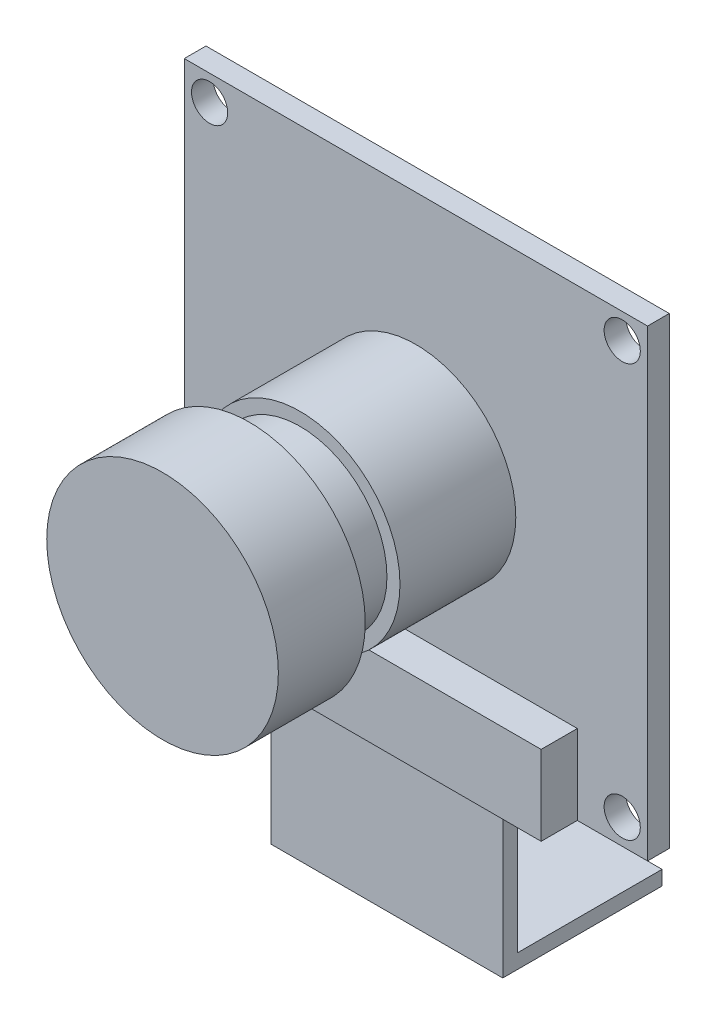
ISO-10303-21;
HEADER;
FILE_DESCRIPTION(('STEP AP214'),'2;1');
FILE_NAME('part.step','',(''),(''),'','','');
FILE_SCHEMA(('AUTOMOTIVE_DESIGN { 1 0 10303 214 1 1 1 1 }'));
ENDSEC;
DATA;
#1=APPLICATION_CONTEXT('core data for automotive mechanical design processes');
#2=APPLICATION_PROTOCOL_DEFINITION('international standard','automotive_design',2000,#1);
#3=PRODUCT_CONTEXT('',#1,'mechanical');
#4=PRODUCT('Part','Part','',(#3));
#5=PRODUCT_RELATED_PRODUCT_CATEGORY('part','',(#4));
#6=PRODUCT_DEFINITION_FORMATION('','',#4);
#7=PRODUCT_DEFINITION_CONTEXT('part definition',#1,'design');
#8=PRODUCT_DEFINITION('design','',#6,#7);
#9=PRODUCT_DEFINITION_SHAPE('','',#8);
#10=(LENGTH_UNIT() NAMED_UNIT(*) SI_UNIT(.MILLI.,.METRE.));
#11=(NAMED_UNIT(*) PLANE_ANGLE_UNIT() SI_UNIT($,.RADIAN.));
#12=(NAMED_UNIT(*) SI_UNIT($,.STERADIAN.) SOLID_ANGLE_UNIT());
#13=UNCERTAINTY_MEASURE_WITH_UNIT(LENGTH_MEASURE(1.E-05),#10,'distance_accuracy_value','');
#14=(GEOMETRIC_REPRESENTATION_CONTEXT(3) GLOBAL_UNCERTAINTY_ASSIGNED_CONTEXT((#13)) GLOBAL_UNIT_ASSIGNED_CONTEXT((#10,
#11,#12)) REPRESENTATION_CONTEXT('',''));
#15=CARTESIAN_POINT('',(0.,0.,0.));
#16=DIRECTION('',(0.,0.,1.));
#17=DIRECTION('',(1.,0.,0.));
#18=AXIS2_PLACEMENT_3D('',#15,#16,#17);
#19=CARTESIAN_POINT('',(0.,0.,1.5));
#20=DIRECTION('',(0.,0.,1.));
#21=DIRECTION('',(1.,0.,0.));
#22=AXIS2_PLACEMENT_3D('',#19,#20,#21);
#23=PLANE('',#22);
#24=CARTESIAN_POINT('',(0.,0.,1.5));
#25=DIRECTION('',(0.,0.,1.));
#26=DIRECTION('',(1.,0.,0.));
#27=AXIS2_PLACEMENT_3D('',#24,#25,#26);
#28=CIRCLE('',#27,6.9);
#29=CARTESIAN_POINT('',(6.9,0.,1.5));
#30=VERTEX_POINT('',#29);
#31=EDGE_CURVE('E231',#30,#30,#28,.T.);
#32=ORIENTED_EDGE('',*,*,#31,.F.);
#33=EDGE_LOOP('',(#32));
#34=FACE_BOUND('',#33,.T.);
#35=CARTESIAN_POINT('',(-14.25,14.25,1.5));
#36=DIRECTION('',(0.,0.,1.));
#37=DIRECTION('',(1.,0.,0.));
#38=AXIS2_PLACEMENT_3D('',#35,#36,#37);
#39=CIRCLE('',#38,1.2500000000001);
#40=CARTESIAN_POINT('',(-12.9999999999999,14.25,1.5));
#41=VERTEX_POINT('',#40);
#42=EDGE_CURVE('E284',#41,#41,#39,.T.);
#43=ORIENTED_EDGE('',*,*,#42,.F.);
#44=EDGE_LOOP('',(#43));
#45=FACE_BOUND('',#44,.T.);
#46=CARTESIAN_POINT('',(-14.25,-14.25,1.5));
#47=DIRECTION('',(0.,0.,1.));
#48=DIRECTION('',(1.,0.,0.));
#49=AXIS2_PLACEMENT_3D('',#46,#47,#48);
#50=CIRCLE('',#49,1.25000000000007);
#51=CARTESIAN_POINT('',(-12.9999999999999,-14.25,1.5));
#52=VERTEX_POINT('',#51);
#53=EDGE_CURVE('E287',#52,#52,#50,.T.);
#54=ORIENTED_EDGE('',*,*,#53,.F.);
#55=EDGE_LOOP('',(#54));
#56=FACE_BOUND('',#55,.T.);
#57=CARTESIAN_POINT('',(14.25,-14.25,1.5));
#58=DIRECTION('',(0.,0.,1.));
#59=DIRECTION('',(1.,0.,0.));
#60=AXIS2_PLACEMENT_3D('',#57,#58,#59);
#61=CIRCLE('',#60,1.25000000000003);
#62=CARTESIAN_POINT('',(15.5,-14.25,1.5));
#63=VERTEX_POINT('',#62);
#64=EDGE_CURVE('E290',#63,#63,#61,.T.);
#65=ORIENTED_EDGE('',*,*,#64,.F.);
#66=EDGE_LOOP('',(#65));
#67=FACE_BOUND('',#66,.T.);
#68=CARTESIAN_POINT('',(14.25,14.25,1.5));
#69=DIRECTION('',(0.,0.,1.));
#70=DIRECTION('',(1.,0.,0.));
#71=AXIS2_PLACEMENT_3D('',#68,#69,#70);
#72=CIRCLE('',#71,1.25);
#73=CARTESIAN_POINT('',(15.5,14.25,1.5));
#74=VERTEX_POINT('',#73);
#75=EDGE_CURVE('E293',#74,#74,#72,.T.);
#76=ORIENTED_EDGE('',*,*,#75,.F.);
#77=EDGE_LOOP('',(#76));
#78=FACE_BOUND('',#77,.T.);
#79=DIRECTION('',(1.,0.,0.));
#80=VECTOR('',#79,1.);
#81=CARTESIAN_POINT('',(0.,-16.,1.5));
#82=LINE('',#81,#80);
#83=CARTESIAN_POINT('',(-16.,-16.,1.5));
#84=VERTEX_POINT('',#83);
#85=CARTESIAN_POINT('',(-11.15,-16.,1.5));
#86=VERTEX_POINT('',#85);
#87=EDGE_CURVE('E276',#84,#86,#82,.T.);
#88=ORIENTED_EDGE('',*,*,#87,.T.);
#89=DIRECTION('',(0.,1.,0.));
#90=VECTOR('',#89,1.);
#91=CARTESIAN_POINT('',(-11.15,0.,1.5));
#92=LINE('',#91,#90);
#93=CARTESIAN_POINT('',(-11.15,-10.5,1.5));
#94=VERTEX_POINT('',#93);
#95=EDGE_CURVE('E238',#86,#94,#92,.T.);
#96=ORIENTED_EDGE('',*,*,#95,.T.);
#97=DIRECTION('',(-1.,0.,0.));
#98=VECTOR('',#97,1.);
#99=CARTESIAN_POINT('',(0.,-10.5,1.5));
#100=LINE('',#99,#98);
#101=CARTESIAN_POINT('',(11.15,-10.5,1.5));
#102=VERTEX_POINT('',#101);
#103=EDGE_CURVE('E254',#102,#94,#100,.T.);
#104=ORIENTED_EDGE('',*,*,#103,.F.);
#105=DIRECTION('',(0.,1.,0.));
#106=VECTOR('',#105,1.);
#107=CARTESIAN_POINT('',(11.15,0.,1.5));
#108=LINE('',#107,#106);
#109=CARTESIAN_POINT('',(11.15,-16.,1.5));
#110=VERTEX_POINT('',#109);
#111=EDGE_CURVE('E245',#110,#102,#108,.T.);
#112=ORIENTED_EDGE('',*,*,#111,.F.);
#113=CARTESIAN_POINT('',(16.,-16.,1.5));
#114=VERTEX_POINT('',#113);
#115=EDGE_CURVE('E274',#110,#114,#82,.T.);
#116=ORIENTED_EDGE('',*,*,#115,.T.);
#117=DIRECTION('',(0.,-1.,0.));
#118=VECTOR('',#117,1.);
#119=CARTESIAN_POINT('',(16.,0.,1.5));
#120=LINE('',#119,#118);
#121=CARTESIAN_POINT('',(16.,16.,1.5));
#122=VERTEX_POINT('',#121);
#123=EDGE_CURVE('E278',#122,#114,#120,.T.);
#124=ORIENTED_EDGE('',*,*,#123,.F.);
#125=DIRECTION('',(1.,0.,0.));
#126=VECTOR('',#125,1.);
#127=CARTESIAN_POINT('',(0.,16.,1.5));
#128=LINE('',#127,#126);
#129=CARTESIAN_POINT('',(-16.,16.,1.5));
#130=VERTEX_POINT('',#129);
#131=EDGE_CURVE('E281',#130,#122,#128,.T.);
#132=ORIENTED_EDGE('',*,*,#131,.F.);
#133=DIRECTION('',(0.,-1.,0.));
#134=VECTOR('',#133,1.);
#135=CARTESIAN_POINT('',(-16.,0.,1.5));
#136=LINE('',#135,#134);
#137=EDGE_CURVE('E271',#130,#84,#136,.T.);
#138=ORIENTED_EDGE('',*,*,#137,.T.);
#139=EDGE_LOOP('',(#88,#96,#104,#112,#116,#124,#132,#138));
#140=FACE_BOUND('',#139,.T.);
#141=ADVANCED_FACE('F58',(#34,#45,#56,#67,#78,#140),#23,.T.);
#142=CARTESIAN_POINT('',(14.25,14.25,1.5));
#143=DIRECTION('',(0.,0.,-1.));
#144=DIRECTION('',(-1.,0.,0.));
#145=AXIS2_PLACEMENT_3D('',#142,#143,#144);
#146=CYLINDRICAL_SURFACE('',#145,1.25);
#147=ORIENTED_EDGE('',*,*,#75,.T.);
#148=EDGE_LOOP('',(#147));
#149=FACE_BOUND('',#148,.T.);
#150=CARTESIAN_POINT('',(14.25,14.25,0.));
#151=DIRECTION('',(0.,0.,1.));
#152=DIRECTION('',(1.,0.,0.));
#153=AXIS2_PLACEMENT_3D('',#150,#151,#152);
#154=CIRCLE('',#153,1.25);
#155=CARTESIAN_POINT('',(15.5,14.25,0.));
#156=VERTEX_POINT('',#155);
#157=EDGE_CURVE('E275',#156,#156,#154,.T.);
#158=ORIENTED_EDGE('',*,*,#157,.F.);
#159=EDGE_LOOP('',(#158));
#160=FACE_BOUND('',#159,.T.);
#161=ADVANCED_FACE('F370',(#149,#160),#146,.F.);
#162=CARTESIAN_POINT('',(14.25,-14.25,1.5));
#163=DIRECTION('',(0.,0.,-1.));
#164=DIRECTION('',(-1.,0.,0.));
#165=AXIS2_PLACEMENT_3D('',#162,#163,#164);
#166=CYLINDRICAL_SURFACE('',#165,1.25000000000003);
#167=ORIENTED_EDGE('',*,*,#64,.T.);
#168=EDGE_LOOP('',(#167));
#169=FACE_BOUND('',#168,.T.);
#170=CARTESIAN_POINT('',(14.25,-14.25,0.));
#171=DIRECTION('',(0.,0.,1.));
#172=DIRECTION('',(1.,0.,0.));
#173=AXIS2_PLACEMENT_3D('',#170,#171,#172);
#174=CIRCLE('',#173,1.25000000000003);
#175=CARTESIAN_POINT('',(15.5,-14.25,0.));
#176=VERTEX_POINT('',#175);
#177=EDGE_CURVE('E314',#176,#176,#174,.T.);
#178=ORIENTED_EDGE('',*,*,#177,.F.);
#179=EDGE_LOOP('',(#178));
#180=FACE_BOUND('',#179,.T.);
#181=ADVANCED_FACE('F376',(#169,#180),#166,.F.);
#182=CARTESIAN_POINT('',(-14.25,-14.25,1.5));
#183=DIRECTION('',(0.,0.,-1.));
#184=DIRECTION('',(-1.,0.,0.));
#185=AXIS2_PLACEMENT_3D('',#182,#183,#184);
#186=CYLINDRICAL_SURFACE('',#185,1.25000000000007);
#187=ORIENTED_EDGE('',*,*,#53,.T.);
#188=EDGE_LOOP('',(#187));
#189=FACE_BOUND('',#188,.T.);
#190=CARTESIAN_POINT('',(-14.25,-14.25,0.));
#191=DIRECTION('',(0.,0.,1.));
#192=DIRECTION('',(1.,0.,0.));
#193=AXIS2_PLACEMENT_3D('',#190,#191,#192);
#194=CIRCLE('',#193,1.25000000000007);
#195=CARTESIAN_POINT('',(-12.9999999999999,-14.25,0.));
#196=VERTEX_POINT('',#195);
#197=EDGE_CURVE('E311',#196,#196,#194,.T.);
#198=ORIENTED_EDGE('',*,*,#197,.F.);
#199=EDGE_LOOP('',(#198));
#200=FACE_BOUND('',#199,.T.);
#201=ADVANCED_FACE('F387',(#189,#200),#186,.F.);
#202=CARTESIAN_POINT('',(-14.25,14.25,1.5));
#203=DIRECTION('',(0.,0.,-1.));
#204=DIRECTION('',(-1.,0.,0.));
#205=AXIS2_PLACEMENT_3D('',#202,#203,#204);
#206=CYLINDRICAL_SURFACE('',#205,1.2500000000001);
#207=ORIENTED_EDGE('',*,*,#42,.T.);
#208=EDGE_LOOP('',(#207));
#209=FACE_BOUND('',#208,.T.);
#210=CARTESIAN_POINT('',(-14.25,14.25,0.));
#211=DIRECTION('',(0.,0.,1.));
#212=DIRECTION('',(1.,0.,0.));
#213=AXIS2_PLACEMENT_3D('',#210,#211,#212);
#214=CIRCLE('',#213,1.2500000000001);
#215=CARTESIAN_POINT('',(-12.9999999999999,14.25,0.));
#216=VERTEX_POINT('',#215);
#217=EDGE_CURVE('E308',#216,#216,#214,.T.);
#218=ORIENTED_EDGE('',*,*,#217,.F.);
#219=EDGE_LOOP('',(#218));
#220=FACE_BOUND('',#219,.T.);
#221=ADVANCED_FACE('F391',(#209,#220),#206,.F.);
#222=CARTESIAN_POINT('',(0.,-16.,1.5));
#223=DIRECTION('',(0.,1.,0.));
#224=DIRECTION('',(0.,0.,1.));
#225=AXIS2_PLACEMENT_3D('',#222,#223,#224);
#226=PLANE('',#225);
#227=DIRECTION('',(1.,0.,0.));
#228=VECTOR('',#227,1.);
#229=CARTESIAN_POINT('',(0.,-16.,3.5));
#230=LINE('',#229,#228);
#231=CARTESIAN_POINT('',(-8.,-16.,3.5));
#232=VERTEX_POINT('',#231);
#233=CARTESIAN_POINT('',(8.,-16.,3.5));
#234=VERTEX_POINT('',#233);
#235=EDGE_CURVE('E73',#232,#234,#230,.T.);
#236=ORIENTED_EDGE('',*,*,#235,.T.);
#237=DIRECTION('',(0.,0.,-1.));
#238=VECTOR('',#237,1.);
#239=CARTESIAN_POINT('',(8.,-16.,0.));
#240=LINE('',#239,#238);
#241=CARTESIAN_POINT('',(8.,-16.,2.5));
#242=VERTEX_POINT('',#241);
#243=EDGE_CURVE('E169',#234,#242,#240,.T.);
#244=ORIENTED_EDGE('',*,*,#243,.T.);
#245=DIRECTION('',(1.,0.,0.));
#246=VECTOR('',#245,1.);
#247=CARTESIAN_POINT('',(0.,-16.,2.5));
#248=LINE('',#247,#246);
#249=CARTESIAN_POINT('',(-8.,-16.,2.5));
#250=VERTEX_POINT('',#249);
#251=EDGE_CURVE('E195',#250,#242,#248,.T.);
#252=ORIENTED_EDGE('',*,*,#251,.F.);
#253=DIRECTION('',(0.,0.,-1.));
#254=VECTOR('',#253,1.);
#255=CARTESIAN_POINT('',(-8.,-16.,0.));
#256=LINE('',#255,#254);
#257=EDGE_CURVE('E78',#232,#250,#256,.T.);
#258=ORIENTED_EDGE('',*,*,#257,.F.);
#259=EDGE_LOOP('',(#236,#244,#252,#258));
#260=FACE_BOUND('',#259,.T.);
#261=DIRECTION('',(1.,0.,0.));
#262=VECTOR('',#261,1.);
#263=CARTESIAN_POINT('',(0.,-16.,0.));
#264=LINE('',#263,#262);
#265=CARTESIAN_POINT('',(-16.,-16.,0.));
#266=VERTEX_POINT('',#265);
#267=CARTESIAN_POINT('',(16.,-16.,0.));
#268=VERTEX_POINT('',#267);
#269=EDGE_CURVE('E299',#266,#268,#264,.T.);
#270=ORIENTED_EDGE('',*,*,#269,.T.);
#271=DIRECTION('',(0.,0.,-1.));
#272=VECTOR('',#271,1.);
#273=CARTESIAN_POINT('',(16.,-16.,1.5));
#274=LINE('',#273,#272);
#275=EDGE_CURVE('E322',#114,#268,#274,.T.);
#276=ORIENTED_EDGE('',*,*,#275,.F.);
#277=ORIENTED_EDGE('',*,*,#115,.F.);
#278=DIRECTION('',(0.,0.,-1.));
#279=VECTOR('',#278,1.);
#280=CARTESIAN_POINT('',(11.15,-16.,4.));
#281=LINE('',#280,#279);
#282=CARTESIAN_POINT('',(11.15,-16.,4.));
#283=VERTEX_POINT('',#282);
#284=EDGE_CURVE('E263',#283,#110,#281,.T.);
#285=ORIENTED_EDGE('',*,*,#284,.F.);
#286=DIRECTION('',(-1.,0.,0.));
#287=VECTOR('',#286,1.);
#288=CARTESIAN_POINT('',(0.,-16.,4.));
#289=LINE('',#288,#287);
#290=CARTESIAN_POINT('',(-11.15,-16.,4.));
#291=VERTEX_POINT('',#290);
#292=EDGE_CURVE('E249',#283,#291,#289,.T.);
#293=ORIENTED_EDGE('',*,*,#292,.T.);
#294=DIRECTION('',(0.,0.,-1.));
#295=VECTOR('',#294,1.);
#296=CARTESIAN_POINT('',(-11.15,-16.,4.));
#297=LINE('',#296,#295);
#298=EDGE_CURVE('E259',#291,#86,#297,.T.);
#299=ORIENTED_EDGE('',*,*,#298,.T.);
#300=ORIENTED_EDGE('',*,*,#87,.F.);
#301=DIRECTION('',(0.,0.,-1.));
#302=VECTOR('',#301,1.);
#303=CARTESIAN_POINT('',(-16.,-16.,1.5));
#304=LINE('',#303,#302);
#305=EDGE_CURVE('E234',#84,#266,#304,.T.);
#306=ORIENTED_EDGE('',*,*,#305,.T.);
#307=EDGE_LOOP('',(#270,#276,#277,#285,#293,#299,#300,#306));
#308=FACE_BOUND('',#307,.T.);
#309=ADVANCED_FACE('F326',(#260,#308),#226,.F.);
#310=CARTESIAN_POINT('',(16.,0.,1.5));
#311=DIRECTION('',(1.,0.,0.));
#312=DIRECTION('',(0.,0.,-1.));
#313=AXIS2_PLACEMENT_3D('',#310,#311,#312);
#314=PLANE('',#313);
#315=DIRECTION('',(0.,-1.,0.));
#316=VECTOR('',#315,1.);
#317=CARTESIAN_POINT('',(16.,0.,0.));
#318=LINE('',#317,#316);
#319=CARTESIAN_POINT('',(16.,16.,0.));
#320=VERTEX_POINT('',#319);
#321=EDGE_CURVE('E302',#320,#268,#318,.T.);
#322=ORIENTED_EDGE('',*,*,#321,.F.);
#323=DIRECTION('',(0.,0.,-1.));
#324=VECTOR('',#323,1.);
#325=CARTESIAN_POINT('',(16.,16.,1.5));
#326=LINE('',#325,#324);
#327=EDGE_CURVE('E320',#122,#320,#326,.T.);
#328=ORIENTED_EDGE('',*,*,#327,.F.);
#329=ORIENTED_EDGE('',*,*,#123,.T.);
#330=ORIENTED_EDGE('',*,*,#275,.T.);
#331=EDGE_LOOP('',(#322,#328,#329,#330));
#332=FACE_BOUND('',#331,.T.);
#333=ADVANCED_FACE('F341',(#332),#314,.T.);
#334=CARTESIAN_POINT('',(0.,16.,1.5));
#335=DIRECTION('',(0.,1.,0.));
#336=DIRECTION('',(0.,0.,1.));
#337=AXIS2_PLACEMENT_3D('',#334,#335,#336);
#338=PLANE('',#337);
#339=DIRECTION('',(1.,0.,0.));
#340=VECTOR('',#339,1.);
#341=CARTESIAN_POINT('',(0.,16.,0.));
#342=LINE('',#341,#340);
#343=CARTESIAN_POINT('',(-16.,16.,0.));
#344=VERTEX_POINT('',#343);
#345=EDGE_CURVE('E305',#344,#320,#342,.T.);
#346=ORIENTED_EDGE('',*,*,#345,.F.);
#347=DIRECTION('',(0.,0.,-1.));
#348=VECTOR('',#347,1.);
#349=CARTESIAN_POINT('',(-16.,16.,1.5));
#350=LINE('',#349,#348);
#351=EDGE_CURVE('E296',#130,#344,#350,.T.);
#352=ORIENTED_EDGE('',*,*,#351,.F.);
#353=ORIENTED_EDGE('',*,*,#131,.T.);
#354=ORIENTED_EDGE('',*,*,#327,.T.);
#355=EDGE_LOOP('',(#346,#352,#353,#354));
#356=FACE_BOUND('',#355,.T.);
#357=ADVANCED_FACE('F336',(#356),#338,.T.);
#358=CARTESIAN_POINT('',(-16.,0.,1.5));
#359=DIRECTION('',(1.,0.,0.));
#360=DIRECTION('',(0.,0.,-1.));
#361=AXIS2_PLACEMENT_3D('',#358,#359,#360);
#362=PLANE('',#361);
#363=DIRECTION('',(0.,-1.,0.));
#364=VECTOR('',#363,1.);
#365=CARTESIAN_POINT('',(-16.,0.,0.));
#366=LINE('',#365,#364);
#367=EDGE_CURVE('E262',#344,#266,#366,.T.);
#368=ORIENTED_EDGE('',*,*,#367,.T.);
#369=ORIENTED_EDGE('',*,*,#305,.F.);
#370=ORIENTED_EDGE('',*,*,#137,.F.);
#371=ORIENTED_EDGE('',*,*,#351,.T.);
#372=EDGE_LOOP('',(#368,#369,#370,#371));
#373=FACE_BOUND('',#372,.T.);
#374=ADVANCED_FACE('F60',(#373),#362,.F.);
#375=CARTESIAN_POINT('',(0.,0.,0.));
#376=DIRECTION('',(0.,0.,1.));
#377=DIRECTION('',(1.,0.,0.));
#378=AXIS2_PLACEMENT_3D('',#375,#376,#377);
#379=PLANE('',#378);
#380=CARTESIAN_POINT('',(-9.50000000000001,0.,0.));
#381=DIRECTION('',(0.,0.,1.));
#382=DIRECTION('',(1.,0.,0.));
#383=AXIS2_PLACEMENT_3D('',#380,#381,#382);
#384=CIRCLE('',#383,1.5);
#385=CARTESIAN_POINT('',(-8.00000000000001,0.,0.));
#386=VERTEX_POINT('',#385);
#387=EDGE_CURVE('E12',#386,#386,#384,.F.);
#388=ORIENTED_EDGE('',*,*,#387,.F.);
#389=EDGE_LOOP('',(#388));
#390=FACE_BOUND('',#389,.T.);
#391=CARTESIAN_POINT('',(9.50000000000001,0.,0.));
#392=DIRECTION('',(0.,0.,1.));
#393=DIRECTION('',(1.,0.,0.));
#394=AXIS2_PLACEMENT_3D('',#391,#392,#393);
#395=CIRCLE('',#394,1.5);
#396=CARTESIAN_POINT('',(11.,0.,0.));
#397=VERTEX_POINT('',#396);
#398=EDGE_CURVE('E216',#397,#397,#395,.T.);
#399=ORIENTED_EDGE('',*,*,#398,.T.);
#400=EDGE_LOOP('',(#399));
#401=FACE_BOUND('',#400,.T.);
#402=ORIENTED_EDGE('',*,*,#367,.F.);
#403=ORIENTED_EDGE('',*,*,#345,.T.);
#404=ORIENTED_EDGE('',*,*,#321,.T.);
#405=ORIENTED_EDGE('',*,*,#269,.F.);
#406=EDGE_LOOP('',(#402,#403,#404,#405));
#407=FACE_BOUND('',#406,.T.);
#408=ORIENTED_EDGE('',*,*,#217,.T.);
#409=EDGE_LOOP('',(#408));
#410=FACE_BOUND('',#409,.T.);
#411=ORIENTED_EDGE('',*,*,#197,.T.);
#412=EDGE_LOOP('',(#411));
#413=FACE_BOUND('',#412,.T.);
#414=ORIENTED_EDGE('',*,*,#177,.T.);
#415=EDGE_LOOP('',(#414));
#416=FACE_BOUND('',#415,.T.);
#417=ORIENTED_EDGE('',*,*,#157,.T.);
#418=EDGE_LOOP('',(#417));
#419=FACE_BOUND('',#418,.T.);
#420=ADVANCED_FACE('F333',(#390,#401,#407,#410,#413,#416,#419),#379,.F.);
#421=CARTESIAN_POINT('',(-11.15,0.,4.));
#422=DIRECTION('',(-1.,0.,0.));
#423=DIRECTION('',(0.,0.,1.));
#424=AXIS2_PLACEMENT_3D('',#421,#422,#423);
#425=PLANE('',#424);
#426=ORIENTED_EDGE('',*,*,#95,.F.);
#427=ORIENTED_EDGE('',*,*,#298,.F.);
#428=DIRECTION('',(0.,1.,0.));
#429=VECTOR('',#428,1.);
#430=CARTESIAN_POINT('',(-11.15,0.,4.));
#431=LINE('',#430,#429);
#432=CARTESIAN_POINT('',(-11.15,-10.5,4.));
#433=VERTEX_POINT('',#432);
#434=EDGE_CURVE('E241',#291,#433,#431,.T.);
#435=ORIENTED_EDGE('',*,*,#434,.T.);
#436=DIRECTION('',(0.,0.,-1.));
#437=VECTOR('',#436,1.);
#438=CARTESIAN_POINT('',(-11.15,-10.5,4.));
#439=LINE('',#438,#437);
#440=EDGE_CURVE('E252',#433,#94,#439,.T.);
#441=ORIENTED_EDGE('',*,*,#440,.T.);
#442=EDGE_LOOP('',(#426,#427,#435,#441));
#443=FACE_BOUND('',#442,.T.);
#444=ADVANCED_FACE('F355',(#443),#425,.T.);
#445=CARTESIAN_POINT('',(11.15,0.,4.));
#446=DIRECTION('',(-1.,0.,0.));
#447=DIRECTION('',(0.,0.,1.));
#448=AXIS2_PLACEMENT_3D('',#445,#446,#447);
#449=PLANE('',#448);
#450=ORIENTED_EDGE('',*,*,#111,.T.);
#451=DIRECTION('',(0.,0.,-1.));
#452=VECTOR('',#451,1.);
#453=CARTESIAN_POINT('',(11.15,-10.5,4.));
#454=LINE('',#453,#452);
#455=CARTESIAN_POINT('',(11.15,-10.5,4.));
#456=VERTEX_POINT('',#455);
#457=EDGE_CURVE('E266',#456,#102,#454,.T.);
#458=ORIENTED_EDGE('',*,*,#457,.F.);
#459=DIRECTION('',(0.,1.,0.));
#460=VECTOR('',#459,1.);
#461=CARTESIAN_POINT('',(11.15,0.,4.));
#462=LINE('',#461,#460);
#463=EDGE_CURVE('E247',#283,#456,#462,.T.);
#464=ORIENTED_EDGE('',*,*,#463,.F.);
#465=ORIENTED_EDGE('',*,*,#284,.T.);
#466=EDGE_LOOP('',(#450,#458,#464,#465));
#467=FACE_BOUND('',#466,.T.);
#468=ADVANCED_FACE('F346',(#467),#449,.F.);
#469=CARTESIAN_POINT('',(0.,-10.5,4.));
#470=DIRECTION('',(0.,-1.,0.));
#471=DIRECTION('',(0.,0.,-1.));
#472=AXIS2_PLACEMENT_3D('',#469,#470,#471);
#473=PLANE('',#472);
#474=ORIENTED_EDGE('',*,*,#103,.T.);
#475=ORIENTED_EDGE('',*,*,#440,.F.);
#476=DIRECTION('',(-1.,0.,0.));
#477=VECTOR('',#476,1.);
#478=CARTESIAN_POINT('',(0.,-10.5,4.));
#479=LINE('',#478,#477);
#480=EDGE_CURVE('E244',#456,#433,#479,.T.);
#481=ORIENTED_EDGE('',*,*,#480,.F.);
#482=ORIENTED_EDGE('',*,*,#457,.T.);
#483=EDGE_LOOP('',(#474,#475,#481,#482));
#484=FACE_BOUND('',#483,.T.);
#485=ADVANCED_FACE('F358',(#484),#473,.F.);
#486=CARTESIAN_POINT('',(0.,0.,4.));
#487=DIRECTION('',(0.,0.,1.));
#488=DIRECTION('',(1.,0.,0.));
#489=AXIS2_PLACEMENT_3D('',#486,#487,#488);
#490=PLANE('',#489);
#491=ORIENTED_EDGE('',*,*,#434,.F.);
#492=ORIENTED_EDGE('',*,*,#292,.F.);
#493=ORIENTED_EDGE('',*,*,#463,.T.);
#494=ORIENTED_EDGE('',*,*,#480,.T.);
#495=EDGE_LOOP('',(#491,#492,#493,#494));
#496=FACE_BOUND('',#495,.T.);
#497=ADVANCED_FACE('F352',(#496),#490,.T.);
#498=CARTESIAN_POINT('',(0.,0.,9.5));
#499=DIRECTION('',(0.,0.,-1.));
#500=DIRECTION('',(-1.,0.,0.));
#501=AXIS2_PLACEMENT_3D('',#498,#499,#500);
#502=CYLINDRICAL_SURFACE('',#501,6.9);
#503=CARTESIAN_POINT('',(0.,0.,9.5));
#504=DIRECTION('',(0.,0.,1.));
#505=DIRECTION('',(1.,0.,0.));
#506=AXIS2_PLACEMENT_3D('',#503,#504,#505);
#507=CIRCLE('',#506,6.9);
#508=CARTESIAN_POINT('',(6.9,0.,9.5));
#509=VERTEX_POINT('',#508);
#510=EDGE_CURVE('E235',#509,#509,#507,.T.);
#511=ORIENTED_EDGE('',*,*,#510,.F.);
#512=EDGE_LOOP('',(#511));
#513=FACE_BOUND('',#512,.T.);
#514=ORIENTED_EDGE('',*,*,#31,.T.);
#515=EDGE_LOOP('',(#514));
#516=FACE_BOUND('',#515,.T.);
#517=ADVANCED_FACE('F365',(#513,#516),#502,.T.);
#518=CARTESIAN_POINT('',(0.,0.,9.5));
#519=DIRECTION('',(0.,0.,1.));
#520=DIRECTION('',(1.,0.,0.));
#521=AXIS2_PLACEMENT_3D('',#518,#519,#520);
#522=PLANE('',#521);
#523=CARTESIAN_POINT('',(0.,0.,9.5));
#524=DIRECTION('',(0.,0.,1.));
#525=DIRECTION('',(1.,0.,0.));
#526=AXIS2_PLACEMENT_3D('',#523,#524,#525);
#527=CIRCLE('',#526,6.);
#528=CARTESIAN_POINT('',(6.,0.,9.5));
#529=VERTEX_POINT('',#528);
#530=EDGE_CURVE('E66',#529,#529,#527,.T.);
#531=ORIENTED_EDGE('',*,*,#530,.F.);
#532=EDGE_LOOP('',(#531));
#533=FACE_BOUND('',#532,.T.);
#534=ORIENTED_EDGE('',*,*,#510,.T.);
#535=EDGE_LOOP('',(#534));
#536=FACE_BOUND('',#535,.T.);
#537=ADVANCED_FACE('F462',(#533,#536),#522,.T.);
#538=CARTESIAN_POINT('',(0.,0.,13.));
#539=DIRECTION('',(0.,0.,-1.));
#540=DIRECTION('',(-1.,0.,0.));
#541=AXIS2_PLACEMENT_3D('',#538,#539,#540);
#542=CYLINDRICAL_SURFACE('',#541,6.);
#543=CARTESIAN_POINT('',(0.,0.,13.));
#544=DIRECTION('',(0.,0.,1.));
#545=DIRECTION('',(1.,0.,0.));
#546=AXIS2_PLACEMENT_3D('',#543,#544,#545);
#547=CIRCLE('',#546,6.);
#548=CARTESIAN_POINT('',(6.,0.,13.));
#549=VERTEX_POINT('',#548);
#550=EDGE_CURVE('E226',#549,#549,#547,.T.);
#551=ORIENTED_EDGE('',*,*,#550,.F.);
#552=EDGE_LOOP('',(#551));
#553=FACE_BOUND('',#552,.T.);
#554=ORIENTED_EDGE('',*,*,#530,.T.);
#555=EDGE_LOOP('',(#554));
#556=FACE_BOUND('',#555,.T.);
#557=ADVANCED_FACE('F473',(#553,#556),#542,.T.);
#558=CARTESIAN_POINT('',(0.,0.,19.));
#559=DIRECTION('',(0.,0.,-1.));
#560=DIRECTION('',(-1.,0.,0.));
#561=AXIS2_PLACEMENT_3D('',#558,#559,#560);
#562=CYLINDRICAL_SURFACE('',#561,8.);
#563=CARTESIAN_POINT('',(0.,0.,19.));
#564=DIRECTION('',(0.,0.,1.));
#565=DIRECTION('',(1.,0.,0.));
#566=AXIS2_PLACEMENT_3D('',#563,#564,#565);
#567=CIRCLE('',#566,8.);
#568=CARTESIAN_POINT('',(7.99999999999999,0.,19.));
#569=VERTEX_POINT('',#568);
#570=EDGE_CURVE('E223',#569,#569,#567,.T.);
#571=ORIENTED_EDGE('',*,*,#570,.F.);
#572=EDGE_LOOP('',(#571));
#573=FACE_BOUND('',#572,.T.);
#574=CARTESIAN_POINT('',(0.,0.,13.));
#575=DIRECTION('',(0.,0.,1.));
#576=DIRECTION('',(1.,0.,0.));
#577=AXIS2_PLACEMENT_3D('',#574,#575,#576);
#578=CIRCLE('',#577,8.);
#579=CARTESIAN_POINT('',(7.99999999999999,0.,13.));
#580=VERTEX_POINT('',#579);
#581=EDGE_CURVE('E220',#580,#580,#578,.T.);
#582=ORIENTED_EDGE('',*,*,#581,.T.);
#583=EDGE_LOOP('',(#582));
#584=FACE_BOUND('',#583,.T.);
#585=ADVANCED_FACE('F484',(#573,#584),#562,.T.);
#586=CARTESIAN_POINT('',(0.,0.,19.));
#587=DIRECTION('',(0.,0.,1.));
#588=DIRECTION('',(1.,0.,0.));
#589=AXIS2_PLACEMENT_3D('',#586,#587,#588);
#590=PLANE('',#589);
#591=ORIENTED_EDGE('',*,*,#570,.T.);
#592=EDGE_LOOP('',(#591));
#593=FACE_BOUND('',#592,.T.);
#594=ADVANCED_FACE('F495',(#593),#590,.T.);
#595=CARTESIAN_POINT('',(0.,0.,13.));
#596=DIRECTION('',(0.,0.,1.));
#597=DIRECTION('',(1.,0.,0.));
#598=AXIS2_PLACEMENT_3D('',#595,#596,#597);
#599=PLANE('',#598);
#600=ORIENTED_EDGE('',*,*,#550,.T.);
#601=EDGE_LOOP('',(#600));
#602=FACE_BOUND('',#601,.T.);
#603=ORIENTED_EDGE('',*,*,#581,.F.);
#604=EDGE_LOOP('',(#603));
#605=FACE_BOUND('',#604,.T.);
#606=ADVANCED_FACE('F506',(#602,#605),#599,.F.);
#607=CARTESIAN_POINT('',(9.50000000000001,0.,-0.5));
#608=DIRECTION('',(0.,0.,1.));
#609=DIRECTION('',(1.,0.,0.));
#610=AXIS2_PLACEMENT_3D('',#607,#608,#609);
#611=CYLINDRICAL_SURFACE('',#610,1.5);
#612=CARTESIAN_POINT('',(9.50000000000001,0.,-0.5));
#613=DIRECTION('',(0.,0.,1.));
#614=DIRECTION('',(1.,0.,0.));
#615=AXIS2_PLACEMENT_3D('',#612,#613,#614);
#616=CIRCLE('',#615,1.5);
#617=CARTESIAN_POINT('',(11.,0.,-0.5));
#618=VERTEX_POINT('',#617);
#619=EDGE_CURVE('E217',#618,#618,#616,.T.);
#620=ORIENTED_EDGE('',*,*,#619,.T.);
#621=EDGE_LOOP('',(#620));
#622=FACE_BOUND('',#621,.T.);
#623=ORIENTED_EDGE('',*,*,#398,.F.);
#624=EDGE_LOOP('',(#623));
#625=FACE_BOUND('',#624,.T.);
#626=ADVANCED_FACE('F515',(#622,#625),#611,.T.);
#627=CARTESIAN_POINT('',(0.,0.,-0.5));
#628=DIRECTION('',(0.,0.,1.));
#629=DIRECTION('',(1.,0.,0.));
#630=AXIS2_PLACEMENT_3D('',#627,#628,#629);
#631=PLANE('',#630);
#632=ORIENTED_EDGE('',*,*,#619,.F.);
#633=EDGE_LOOP('',(#632));
#634=FACE_BOUND('',#633,.T.);
#635=ADVANCED_FACE('F532',(#634),#631,.F.);
#636=CARTESIAN_POINT('',(-9.50000000000001,0.,-0.5));
#637=DIRECTION('',(0.,0.,1.));
#638=DIRECTION('',(1.,0.,0.));
#639=AXIS2_PLACEMENT_3D('',#636,#637,#638);
#640=CYLINDRICAL_SURFACE('',#639,1.5);
#641=CARTESIAN_POINT('',(-9.50000000000001,0.,-0.5));
#642=DIRECTION('',(0.,0.,1.));
#643=DIRECTION('',(1.,0.,0.));
#644=AXIS2_PLACEMENT_3D('',#641,#642,#643);
#645=CIRCLE('',#644,1.5);
#646=CARTESIAN_POINT('',(-8.00000000000001,0.,-0.5));
#647=VERTEX_POINT('',#646);
#648=EDGE_CURVE('E213',#647,#647,#645,.F.);
#649=ORIENTED_EDGE('',*,*,#648,.F.);
#650=EDGE_LOOP('',(#649));
#651=FACE_BOUND('',#650,.T.);
#652=ORIENTED_EDGE('',*,*,#387,.T.);
#653=EDGE_LOOP('',(#652));
#654=FACE_BOUND('',#653,.T.);
#655=ADVANCED_FACE('F543',(#651,#654),#640,.T.);
#656=CARTESIAN_POINT('',(0.,0.,-0.5));
#657=DIRECTION('',(0.,0.,1.));
#658=DIRECTION('',(1.,0.,0.));
#659=AXIS2_PLACEMENT_3D('',#656,#657,#658);
#660=PLANE('',#659);
#661=ORIENTED_EDGE('',*,*,#648,.T.);
#662=EDGE_LOOP('',(#661));
#663=FACE_BOUND('',#662,.T.);
#664=ADVANCED_FACE('F554',(#663),#660,.F.);
#665=CARTESIAN_POINT('',(8.,-26.,0.));
#666=DIRECTION('',(1.,0.,0.));
#667=DIRECTION('',(0.,0.,-1.));
#668=AXIS2_PLACEMENT_3D('',#665,#666,#667);
#669=PLANE('',#668);
#670=ORIENTED_EDGE('',*,*,#243,.F.);
#671=DIRECTION('',(0.,1.,0.));
#672=VECTOR('',#671,1.);
#673=CARTESIAN_POINT('',(8.,-26.,3.5));
#674=LINE('',#673,#672);
#675=CARTESIAN_POINT('',(8.,-26.,3.5));
#676=VERTEX_POINT('',#675);
#677=EDGE_CURVE('E211',#676,#234,#674,.T.);
#678=ORIENTED_EDGE('',*,*,#677,.F.);
#679=DIRECTION('',(0.,0.,-1.));
#680=VECTOR('',#679,1.);
#681=CARTESIAN_POINT('',(8.,-26.,0.));
#682=LINE('',#681,#680);
#683=CARTESIAN_POINT('',(8.,-26.,-7.5));
#684=VERTEX_POINT('',#683);
#685=EDGE_CURVE('E177',#676,#684,#682,.T.);
#686=ORIENTED_EDGE('',*,*,#685,.T.);
#687=DIRECTION('',(0.,-1.,0.));
#688=VECTOR('',#687,1.);
#689=CARTESIAN_POINT('',(8.,0.,-7.5));
#690=LINE('',#689,#688);
#691=CARTESIAN_POINT('',(8.,-25.,-7.5));
#692=VERTEX_POINT('',#691);
#693=EDGE_CURVE('E173',#692,#684,#690,.T.);
#694=ORIENTED_EDGE('',*,*,#693,.F.);
#695=DIRECTION('',(0.,0.,1.));
#696=VECTOR('',#695,1.);
#697=CARTESIAN_POINT('',(8.,-25.,-7.5));
#698=LINE('',#697,#696);
#699=CARTESIAN_POINT('',(8.,-25.,2.5));
#700=VERTEX_POINT('',#699);
#701=EDGE_CURVE('E160',#692,#700,#698,.T.);
#702=ORIENTED_EDGE('',*,*,#701,.T.);
#703=DIRECTION('',(0.,1.,0.));
#704=VECTOR('',#703,1.);
#705=CARTESIAN_POINT('',(8.,-26.,2.5));
#706=LINE('',#705,#704);
#707=EDGE_CURVE('E200',#700,#242,#706,.T.);
#708=ORIENTED_EDGE('',*,*,#707,.T.);
#709=EDGE_LOOP('',(#670,#678,#686,#694,#702,#708));
#710=FACE_BOUND('',#709,.T.);
#711=ADVANCED_FACE('F175',(#710),#669,.T.);
#712=CARTESIAN_POINT('',(0.,-26.,3.5));
#713=DIRECTION('',(0.,0.,1.));
#714=DIRECTION('',(1.,0.,0.));
#715=AXIS2_PLACEMENT_3D('',#712,#713,#714);
#716=PLANE('',#715);
#717=ORIENTED_EDGE('',*,*,#235,.F.);
#718=DIRECTION('',(0.,1.,0.));
#719=VECTOR('',#718,1.);
#720=CARTESIAN_POINT('',(-8.,-26.,3.5));
#721=LINE('',#720,#719);
#722=CARTESIAN_POINT('',(-8.,-26.,3.5));
#723=VERTEX_POINT('',#722);
#724=EDGE_CURVE('E209',#723,#232,#721,.T.);
#725=ORIENTED_EDGE('',*,*,#724,.F.);
#726=DIRECTION('',(1.,0.,0.));
#727=VECTOR('',#726,1.);
#728=CARTESIAN_POINT('',(0.,-26.,3.5));
#729=LINE('',#728,#727);
#730=EDGE_CURVE('E194',#723,#676,#729,.T.);
#731=ORIENTED_EDGE('',*,*,#730,.T.);
#732=ORIENTED_EDGE('',*,*,#677,.T.);
#733=EDGE_LOOP('',(#717,#725,#731,#732));
#734=FACE_BOUND('',#733,.T.);
#735=ADVANCED_FACE('F574',(#734),#716,.T.);
#736=CARTESIAN_POINT('',(-8.,-26.,0.));
#737=DIRECTION('',(1.,0.,0.));
#738=DIRECTION('',(0.,0.,-1.));
#739=AXIS2_PLACEMENT_3D('',#736,#737,#738);
#740=PLANE('',#739);
#741=ORIENTED_EDGE('',*,*,#257,.T.);
#742=DIRECTION('',(0.,1.,0.));
#743=VECTOR('',#742,1.);
#744=CARTESIAN_POINT('',(-8.,-26.,2.5));
#745=LINE('',#744,#743);
#746=CARTESIAN_POINT('',(-8.,-25.,2.5));
#747=VERTEX_POINT('',#746);
#748=EDGE_CURVE('E207',#747,#250,#745,.T.);
#749=ORIENTED_EDGE('',*,*,#748,.F.);
#750=DIRECTION('',(0.,0.,1.));
#751=VECTOR('',#750,1.);
#752=CARTESIAN_POINT('',(-8.,-25.,-7.5));
#753=LINE('',#752,#751);
#754=CARTESIAN_POINT('',(-8.,-25.,-7.5));
#755=VERTEX_POINT('',#754);
#756=EDGE_CURVE('E170',#755,#747,#753,.T.);
#757=ORIENTED_EDGE('',*,*,#756,.F.);
#758=DIRECTION('',(0.,1.,0.));
#759=VECTOR('',#758,1.);
#760=CARTESIAN_POINT('',(-8.,0.,-7.5));
#761=LINE('',#760,#759);
#762=CARTESIAN_POINT('',(-8.,-26.,-7.5));
#763=VERTEX_POINT('',#762);
#764=EDGE_CURVE('E185',#763,#755,#761,.T.);
#765=ORIENTED_EDGE('',*,*,#764,.F.);
#766=DIRECTION('',(0.,0.,-1.));
#767=VECTOR('',#766,1.);
#768=CARTESIAN_POINT('',(-8.,-26.,0.));
#769=LINE('',#768,#767);
#770=EDGE_CURVE('E198',#723,#763,#769,.T.);
#771=ORIENTED_EDGE('',*,*,#770,.F.);
#772=ORIENTED_EDGE('',*,*,#724,.T.);
#773=EDGE_LOOP('',(#741,#749,#757,#765,#771,#772));
#774=FACE_BOUND('',#773,.T.);
#775=ADVANCED_FACE('F579',(#774),#740,.F.);
#776=CARTESIAN_POINT('',(0.,-26.,2.5));
#777=DIRECTION('',(0.,0.,1.));
#778=DIRECTION('',(1.,0.,0.));
#779=AXIS2_PLACEMENT_3D('',#776,#777,#778);
#780=PLANE('',#779);
#781=ORIENTED_EDGE('',*,*,#707,.F.);
#782=DIRECTION('',(-1.,0.,0.));
#783=VECTOR('',#782,1.);
#784=CARTESIAN_POINT('',(0.,-25.,2.5));
#785=LINE('',#784,#783);
#786=EDGE_CURVE('E166',#700,#747,#785,.T.);
#787=ORIENTED_EDGE('',*,*,#786,.T.);
#788=ORIENTED_EDGE('',*,*,#748,.T.);
#789=ORIENTED_EDGE('',*,*,#251,.T.);
#790=EDGE_LOOP('',(#781,#787,#788,#789));
#791=FACE_BOUND('',#790,.T.);
#792=ADVANCED_FACE('F600',(#791),#780,.F.);
#793=CARTESIAN_POINT('',(0.,-26.,0.));
#794=DIRECTION('',(0.,-1.,0.));
#795=DIRECTION('',(0.,0.,-1.));
#796=AXIS2_PLACEMENT_3D('',#793,#794,#795);
#797=PLANE('',#796);
#798=ORIENTED_EDGE('',*,*,#685,.F.);
#799=ORIENTED_EDGE('',*,*,#730,.F.);
#800=ORIENTED_EDGE('',*,*,#770,.T.);
#801=DIRECTION('',(-1.,0.,0.));
#802=VECTOR('',#801,1.);
#803=CARTESIAN_POINT('',(0.,-26.,-7.5));
#804=LINE('',#803,#802);
#805=EDGE_CURVE('E181',#684,#763,#804,.T.);
#806=ORIENTED_EDGE('',*,*,#805,.F.);
#807=EDGE_LOOP('',(#798,#799,#800,#806));
#808=FACE_BOUND('',#807,.T.);
#809=ADVANCED_FACE('F611',(#808),#797,.T.);
#810=CARTESIAN_POINT('',(0.,-25.,-7.5));
#811=DIRECTION('',(0.,1.,0.));
#812=DIRECTION('',(0.,0.,1.));
#813=AXIS2_PLACEMENT_3D('',#810,#811,#812);
#814=PLANE('',#813);
#815=ORIENTED_EDGE('',*,*,#786,.F.);
#816=ORIENTED_EDGE('',*,*,#701,.F.);
#817=DIRECTION('',(-1.,0.,0.));
#818=VECTOR('',#817,1.);
#819=CARTESIAN_POINT('',(0.,-25.,-7.5));
#820=LINE('',#819,#818);
#821=EDGE_CURVE('E164',#692,#755,#820,.T.);
#822=ORIENTED_EDGE('',*,*,#821,.T.);
#823=ORIENTED_EDGE('',*,*,#756,.T.);
#824=EDGE_LOOP('',(#815,#816,#822,#823));
#825=FACE_BOUND('',#824,.T.);
#826=ADVANCED_FACE('F162',(#825),#814,.T.);
#827=CARTESIAN_POINT('',(0.,0.,-7.5));
#828=DIRECTION('',(0.,0.,-1.));
#829=DIRECTION('',(-1.,0.,0.));
#830=AXIS2_PLACEMENT_3D('',#827,#828,#829);
#831=PLANE('',#830);
#832=ORIENTED_EDGE('',*,*,#821,.F.);
#833=ORIENTED_EDGE('',*,*,#693,.T.);
#834=ORIENTED_EDGE('',*,*,#805,.T.);
#835=ORIENTED_EDGE('',*,*,#764,.T.);
#836=EDGE_LOOP('',(#832,#833,#834,#835));
#837=FACE_BOUND('',#836,.T.);
#838=ADVANCED_FACE('F183',(#837),#831,.T.);
#839=CLOSED_SHELL('',(#141,#161,#181,#201,#221,#309,#333,#357,#374,#420,#444,#468,#485,#497,
#517,#537,#557,#585,#594,#606,#626,#635,#655,#664,#711,#735,#775,#792,#809,#826,#838));
#840=MANIFOLD_SOLID_BREP('B2',#839);
#841=ADVANCED_BREP_SHAPE_REPRESENTATION('',(#18,#840),#14);
#842=SHAPE_DEFINITION_REPRESENTATION(#9,#841);
ENDSEC;
END-ISO-10303-21;
